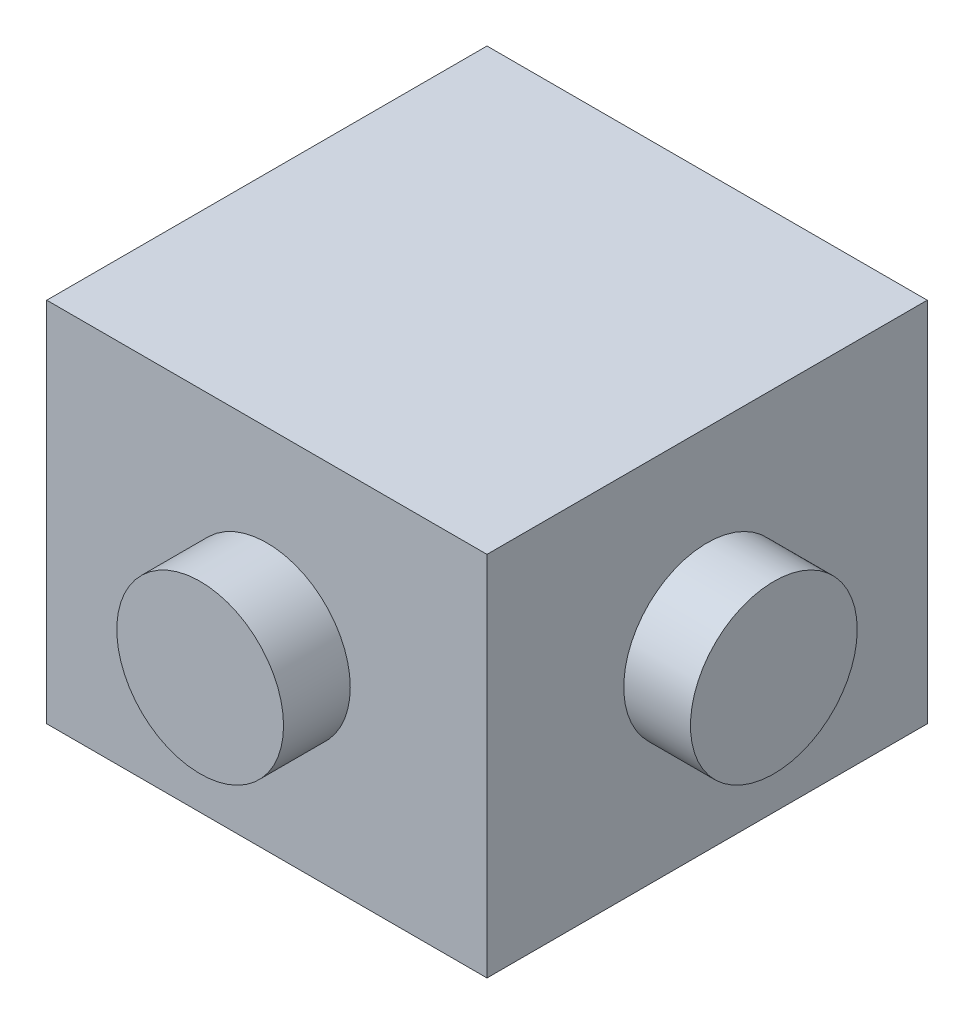
ISO-10303-21;
HEADER;
FILE_DESCRIPTION(('STEP AP214'),'2;1');
FILE_NAME('part.step','',(''),(''),'','','');
FILE_SCHEMA(('AUTOMOTIVE_DESIGN { 1 0 10303 214 1 1 1 1 }'));
ENDSEC;
DATA;
#1=APPLICATION_CONTEXT('core data for automotive mechanical design processes');
#2=APPLICATION_PROTOCOL_DEFINITION('international standard','automotive_design',2000,#1);
#3=PRODUCT_CONTEXT('',#1,'mechanical');
#4=PRODUCT('Part','Part','',(#3));
#5=PRODUCT_RELATED_PRODUCT_CATEGORY('part','',(#4));
#6=PRODUCT_DEFINITION_FORMATION('','',#4);
#7=PRODUCT_DEFINITION_CONTEXT('part definition',#1,'design');
#8=PRODUCT_DEFINITION('design','',#6,#7);
#9=PRODUCT_DEFINITION_SHAPE('','',#8);
#10=(LENGTH_UNIT() NAMED_UNIT(*) SI_UNIT(.MILLI.,.METRE.));
#11=(NAMED_UNIT(*) PLANE_ANGLE_UNIT() SI_UNIT($,.RADIAN.));
#12=(NAMED_UNIT(*) SI_UNIT($,.STERADIAN.) SOLID_ANGLE_UNIT());
#13=UNCERTAINTY_MEASURE_WITH_UNIT(LENGTH_MEASURE(1.E-05),#10,'distance_accuracy_value','');
#14=(GEOMETRIC_REPRESENTATION_CONTEXT(3) GLOBAL_UNCERTAINTY_ASSIGNED_CONTEXT((#13)) GLOBAL_UNIT_ASSIGNED_CONTEXT((#10,
#11,#12)) REPRESENTATION_CONTEXT('',''));
#15=CARTESIAN_POINT('',(0.,0.,0.));
#16=DIRECTION('',(0.,0.,1.));
#17=DIRECTION('',(1.,0.,0.));
#18=AXIS2_PLACEMENT_3D('',#15,#16,#17);
#19=CARTESIAN_POINT('',(8.382,13.97,8.382));
#20=DIRECTION('',(-1.,0.,0.));
#21=DIRECTION('',(0.,0.,1.));
#22=AXIS2_PLACEMENT_3D('',#19,#20,#21);
#23=PLANE('',#22);
#24=CARTESIAN_POINT('',(8.382,6.985,0.));
#25=DIRECTION('',(1.,0.,0.));
#26=DIRECTION('',(0.,0.,-1.));
#27=AXIS2_PLACEMENT_3D('',#24,#25,#26);
#28=CIRCLE('',#27,3.175);
#29=CARTESIAN_POINT('',(8.382,6.985,-3.175));
#30=VERTEX_POINT('',#29);
#31=EDGE_CURVE('E11',#30,#30,#28,.T.);
#32=ORIENTED_EDGE('',*,*,#31,.F.);
#33=EDGE_LOOP('',(#32));
#34=FACE_BOUND('',#33,.T.);
#35=DIRECTION('',(0.,0.,-1.));
#36=VECTOR('',#35,1.);
#37=CARTESIAN_POINT('',(8.382,0.,8.382));
#38=LINE('',#37,#36);
#39=CARTESIAN_POINT('',(8.382,0.,8.382));
#40=VERTEX_POINT('',#39);
#41=CARTESIAN_POINT('',(8.382,0.,-8.382));
#42=VERTEX_POINT('',#41);
#43=EDGE_CURVE('E111',#40,#42,#38,.T.);
#44=ORIENTED_EDGE('',*,*,#43,.T.);
#45=DIRECTION('',(0.,-1.,0.));
#46=VECTOR('',#45,1.);
#47=CARTESIAN_POINT('',(8.382,13.97,-8.382));
#48=LINE('',#47,#46);
#49=CARTESIAN_POINT('',(8.382,13.97,-8.382));
#50=VERTEX_POINT('',#49);
#51=EDGE_CURVE('E42',#50,#42,#48,.T.);
#52=ORIENTED_EDGE('',*,*,#51,.F.);
#53=DIRECTION('',(0.,0.,-1.));
#54=VECTOR('',#53,1.);
#55=CARTESIAN_POINT('',(8.382,13.97,8.382));
#56=LINE('',#55,#54);
#57=CARTESIAN_POINT('',(8.382,13.97,8.382));
#58=VERTEX_POINT('',#57);
#59=EDGE_CURVE('E94',#58,#50,#56,.T.);
#60=ORIENTED_EDGE('',*,*,#59,.F.);
#61=DIRECTION('',(0.,-1.,0.));
#62=VECTOR('',#61,1.);
#63=CARTESIAN_POINT('',(8.382,13.97,8.382));
#64=LINE('',#63,#62);
#65=EDGE_CURVE('E107',#58,#40,#64,.T.);
#66=ORIENTED_EDGE('',*,*,#65,.T.);
#67=EDGE_LOOP('',(#44,#52,#60,#66));
#68=FACE_BOUND('',#67,.T.);
#69=ADVANCED_FACE('F39',(#34,#68),#23,.F.);
#70=CARTESIAN_POINT('',(-8.382,13.97,-8.382));
#71=DIRECTION('',(0.,0.,1.));
#72=DIRECTION('',(1.,0.,0.));
#73=AXIS2_PLACEMENT_3D('',#70,#71,#72);
#74=PLANE('',#73);
#75=CARTESIAN_POINT('',(0.,6.985,-8.382));
#76=DIRECTION('',(0.,0.,1.));
#77=DIRECTION('',(1.,0.,0.));
#78=AXIS2_PLACEMENT_3D('',#75,#76,#77);
#79=CIRCLE('',#78,3.175);
#80=CARTESIAN_POINT('',(3.175,6.985,-8.382));
#81=VERTEX_POINT('',#80);
#82=EDGE_CURVE('E139',#81,#81,#79,.T.);
#83=ORIENTED_EDGE('',*,*,#82,.T.);
#84=EDGE_LOOP('',(#83));
#85=FACE_BOUND('',#84,.T.);
#86=DIRECTION('',(-1.,0.,0.));
#87=VECTOR('',#86,1.);
#88=CARTESIAN_POINT('',(-8.382,0.,-8.382));
#89=LINE('',#88,#87);
#90=CARTESIAN_POINT('',(-8.382,0.,-8.382));
#91=VERTEX_POINT('',#90);
#92=EDGE_CURVE('E100',#42,#91,#89,.T.);
#93=ORIENTED_EDGE('',*,*,#92,.T.);
#94=DIRECTION('',(0.,-1.,0.));
#95=VECTOR('',#94,1.);
#96=CARTESIAN_POINT('',(-8.382,13.97,-8.382));
#97=LINE('',#96,#95);
#98=CARTESIAN_POINT('',(-8.382,13.97,-8.382));
#99=VERTEX_POINT('',#98);
#100=EDGE_CURVE('E98',#99,#91,#97,.T.);
#101=ORIENTED_EDGE('',*,*,#100,.F.);
#102=DIRECTION('',(-1.,0.,0.));
#103=VECTOR('',#102,1.);
#104=CARTESIAN_POINT('',(-8.382,13.97,-8.382));
#105=LINE('',#104,#103);
#106=EDGE_CURVE('E89',#50,#99,#105,.T.);
#107=ORIENTED_EDGE('',*,*,#106,.F.);
#108=ORIENTED_EDGE('',*,*,#51,.T.);
#109=EDGE_LOOP('',(#93,#101,#107,#108));
#110=FACE_BOUND('',#109,.T.);
#111=ADVANCED_FACE('F99',(#85,#110),#74,.F.);
#112=CARTESIAN_POINT('',(-8.382,13.97,8.382));
#113=DIRECTION('',(1.,0.,0.));
#114=DIRECTION('',(0.,0.,-1.));
#115=AXIS2_PLACEMENT_3D('',#112,#113,#114);
#116=PLANE('',#115);
#117=CARTESIAN_POINT('',(-8.382,6.985,0.));
#118=DIRECTION('',(1.,0.,0.));
#119=DIRECTION('',(0.,0.,-1.));
#120=AXIS2_PLACEMENT_3D('',#117,#118,#119);
#121=CIRCLE('',#120,3.175);
#122=CARTESIAN_POINT('',(-8.382,6.985,-3.175));
#123=VERTEX_POINT('',#122);
#124=EDGE_CURVE('E151',#123,#123,#121,.T.);
#125=ORIENTED_EDGE('',*,*,#124,.T.);
#126=EDGE_LOOP('',(#125));
#127=FACE_BOUND('',#126,.T.);
#128=DIRECTION('',(0.,0.,1.));
#129=VECTOR('',#128,1.);
#130=CARTESIAN_POINT('',(-8.382,0.,8.382));
#131=LINE('',#130,#129);
#132=CARTESIAN_POINT('',(-8.382,0.,8.382));
#133=VERTEX_POINT('',#132);
#134=EDGE_CURVE('E75',#91,#133,#131,.T.);
#135=ORIENTED_EDGE('',*,*,#134,.T.);
#136=DIRECTION('',(0.,-1.,0.));
#137=VECTOR('',#136,1.);
#138=CARTESIAN_POINT('',(-8.382,13.97,8.382));
#139=LINE('',#138,#137);
#140=CARTESIAN_POINT('',(-8.382,13.97,8.382));
#141=VERTEX_POINT('',#140);
#142=EDGE_CURVE('E102',#141,#133,#139,.T.);
#143=ORIENTED_EDGE('',*,*,#142,.F.);
#144=DIRECTION('',(0.,0.,1.));
#145=VECTOR('',#144,1.);
#146=CARTESIAN_POINT('',(-8.382,13.97,8.382));
#147=LINE('',#146,#145);
#148=EDGE_CURVE('E92',#99,#141,#147,.T.);
#149=ORIENTED_EDGE('',*,*,#148,.F.);
#150=ORIENTED_EDGE('',*,*,#100,.T.);
#151=EDGE_LOOP('',(#135,#143,#149,#150));
#152=FACE_BOUND('',#151,.T.);
#153=ADVANCED_FACE('F103',(#127,#152),#116,.F.);
#154=CARTESIAN_POINT('',(-8.382,13.97,8.382));
#155=DIRECTION('',(0.,0.,-1.));
#156=DIRECTION('',(-1.,0.,0.));
#157=AXIS2_PLACEMENT_3D('',#154,#155,#156);
#158=PLANE('',#157);
#159=CARTESIAN_POINT('',(0.,6.985,8.382));
#160=DIRECTION('',(0.,0.,1.));
#161=DIRECTION('',(1.,0.,0.));
#162=AXIS2_PLACEMENT_3D('',#159,#160,#161);
#163=CIRCLE('',#162,3.175);
#164=CARTESIAN_POINT('',(3.175,6.985,8.382));
#165=VERTEX_POINT('',#164);
#166=EDGE_CURVE('E49',#165,#165,#163,.T.);
#167=ORIENTED_EDGE('',*,*,#166,.F.);
#168=EDGE_LOOP('',(#167));
#169=FACE_BOUND('',#168,.T.);
#170=DIRECTION('',(1.,0.,0.));
#171=VECTOR('',#170,1.);
#172=CARTESIAN_POINT('',(-8.382,0.,8.382));
#173=LINE('',#172,#171);
#174=EDGE_CURVE('E81',#133,#40,#173,.T.);
#175=ORIENTED_EDGE('',*,*,#174,.T.);
#176=ORIENTED_EDGE('',*,*,#65,.F.);
#177=DIRECTION('',(1.,0.,0.));
#178=VECTOR('',#177,1.);
#179=CARTESIAN_POINT('',(-8.382,13.97,8.382));
#180=LINE('',#179,#178);
#181=EDGE_CURVE('E58',#141,#58,#180,.T.);
#182=ORIENTED_EDGE('',*,*,#181,.F.);
#183=ORIENTED_EDGE('',*,*,#142,.T.);
#184=EDGE_LOOP('',(#175,#176,#182,#183));
#185=FACE_BOUND('',#184,.T.);
#186=ADVANCED_FACE('F125',(#169,#185),#158,.F.);
#187=CARTESIAN_POINT('',(0.,13.97,0.));
#188=DIRECTION('',(0.,-1.,0.));
#189=DIRECTION('',(0.,0.,-1.));
#190=AXIS2_PLACEMENT_3D('',#187,#188,#189);
#191=PLANE('',#190);
#192=ORIENTED_EDGE('',*,*,#59,.T.);
#193=ORIENTED_EDGE('',*,*,#106,.T.);
#194=ORIENTED_EDGE('',*,*,#148,.T.);
#195=ORIENTED_EDGE('',*,*,#181,.T.);
#196=EDGE_LOOP('',(#192,#193,#194,#195));
#197=FACE_BOUND('',#196,.T.);
#198=ADVANCED_FACE('F90',(#197),#191,.F.);
#199=CARTESIAN_POINT('',(0.,0.,0.));
#200=DIRECTION('',(0.,-1.,0.));
#201=DIRECTION('',(0.,0.,-1.));
#202=AXIS2_PLACEMENT_3D('',#199,#200,#201);
#203=PLANE('',#202);
#204=ORIENTED_EDGE('',*,*,#43,.F.);
#205=ORIENTED_EDGE('',*,*,#174,.F.);
#206=ORIENTED_EDGE('',*,*,#134,.F.);
#207=ORIENTED_EDGE('',*,*,#92,.F.);
#208=EDGE_LOOP('',(#204,#205,#206,#207));
#209=FACE_BOUND('',#208,.T.);
#210=ADVANCED_FACE('F128',(#209),#203,.T.);
#211=CARTESIAN_POINT('',(0.,6.985,10.922));
#212=DIRECTION('',(0.,0.,-1.));
#213=DIRECTION('',(-1.,0.,0.));
#214=AXIS2_PLACEMENT_3D('',#211,#212,#213);
#215=CYLINDRICAL_SURFACE('',#214,3.175);
#216=CARTESIAN_POINT('',(0.,6.985,10.922));
#217=DIRECTION('',(0.,0.,1.));
#218=DIRECTION('',(1.,0.,0.));
#219=AXIS2_PLACEMENT_3D('',#216,#217,#218);
#220=CIRCLE('',#219,3.175);
#221=CARTESIAN_POINT('',(3.175,6.985,10.922));
#222=VERTEX_POINT('',#221);
#223=EDGE_CURVE('E115',#222,#222,#220,.T.);
#224=ORIENTED_EDGE('',*,*,#223,.F.);
#225=EDGE_LOOP('',(#224));
#226=FACE_BOUND('',#225,.T.);
#227=ORIENTED_EDGE('',*,*,#166,.T.);
#228=EDGE_LOOP('',(#227));
#229=FACE_BOUND('',#228,.T.);
#230=ADVANCED_FACE('F201',(#226,#229),#215,.T.);
#231=CARTESIAN_POINT('',(0.,6.985,10.922));
#232=DIRECTION('',(0.,0.,1.));
#233=DIRECTION('',(1.,0.,0.));
#234=AXIS2_PLACEMENT_3D('',#231,#232,#233);
#235=PLANE('',#234);
#236=ORIENTED_EDGE('',*,*,#223,.T.);
#237=EDGE_LOOP('',(#236));
#238=FACE_BOUND('',#237,.T.);
#239=ADVANCED_FACE('F197',(#238),#235,.T.);
#240=CARTESIAN_POINT('',(0.,6.985,-10.922));
#241=DIRECTION('',(0.,0.,1.));
#242=DIRECTION('',(1.,0.,0.));
#243=AXIS2_PLACEMENT_3D('',#240,#241,#242);
#244=CYLINDRICAL_SURFACE('',#243,3.175);
#245=CARTESIAN_POINT('',(0.,6.985,-10.922));
#246=DIRECTION('',(0.,0.,1.));
#247=DIRECTION('',(1.,0.,0.));
#248=AXIS2_PLACEMENT_3D('',#245,#246,#247);
#249=CIRCLE('',#248,3.175);
#250=CARTESIAN_POINT('',(3.175,6.985,-10.922));
#251=VERTEX_POINT('',#250);
#252=EDGE_CURVE('E138',#251,#251,#249,.T.);
#253=ORIENTED_EDGE('',*,*,#252,.T.);
#254=EDGE_LOOP('',(#253));
#255=FACE_BOUND('',#254,.T.);
#256=ORIENTED_EDGE('',*,*,#82,.F.);
#257=EDGE_LOOP('',(#256));
#258=FACE_BOUND('',#257,.T.);
#259=ADVANCED_FACE('F190',(#255,#258),#244,.T.);
#260=CARTESIAN_POINT('',(0.,6.985,-10.922));
#261=DIRECTION('',(0.,0.,-1.));
#262=DIRECTION('',(1.,0.,0.));
#263=AXIS2_PLACEMENT_3D('',#260,#261,#262);
#264=PLANE('',#263);
#265=ORIENTED_EDGE('',*,*,#252,.F.);
#266=EDGE_LOOP('',(#265));
#267=FACE_BOUND('',#266,.T.);
#268=ADVANCED_FACE('F182',(#267),#264,.T.);
#269=CARTESIAN_POINT('',(10.922,6.985,0.));
#270=DIRECTION('',(-1.,0.,0.));
#271=DIRECTION('',(0.,0.,1.));
#272=AXIS2_PLACEMENT_3D('',#269,#270,#271);
#273=CYLINDRICAL_SURFACE('',#272,3.175);
#274=CARTESIAN_POINT('',(10.922,6.985,0.));
#275=DIRECTION('',(1.,0.,0.));
#276=DIRECTION('',(0.,0.,-1.));
#277=AXIS2_PLACEMENT_3D('',#274,#275,#276);
#278=CIRCLE('',#277,3.175);
#279=CARTESIAN_POINT('',(10.922,6.985,-3.175));
#280=VERTEX_POINT('',#279);
#281=EDGE_CURVE('E143',#280,#280,#278,.T.);
#282=ORIENTED_EDGE('',*,*,#281,.F.);
#283=EDGE_LOOP('',(#282));
#284=FACE_BOUND('',#283,.T.);
#285=ORIENTED_EDGE('',*,*,#31,.T.);
#286=EDGE_LOOP('',(#285));
#287=FACE_BOUND('',#286,.T.);
#288=ADVANCED_FACE('F180',(#284,#287),#273,.T.);
#289=CARTESIAN_POINT('',(10.922,6.985,0.));
#290=DIRECTION('',(1.,0.,0.));
#291=DIRECTION('',(0.,0.,-1.));
#292=AXIS2_PLACEMENT_3D('',#289,#290,#291);
#293=PLANE('',#292);
#294=ORIENTED_EDGE('',*,*,#281,.T.);
#295=EDGE_LOOP('',(#294));
#296=FACE_BOUND('',#295,.T.);
#297=ADVANCED_FACE('F168',(#296),#293,.T.);
#298=CARTESIAN_POINT('',(-10.922,6.985,0.));
#299=DIRECTION('',(1.,0.,0.));
#300=DIRECTION('',(0.,0.,-1.));
#301=AXIS2_PLACEMENT_3D('',#298,#299,#300);
#302=CYLINDRICAL_SURFACE('',#301,3.175);
#303=CARTESIAN_POINT('',(-10.922,6.985,0.));
#304=DIRECTION('',(1.,0.,0.));
#305=DIRECTION('',(0.,0.,-1.));
#306=AXIS2_PLACEMENT_3D('',#303,#304,#305);
#307=CIRCLE('',#306,3.175);
#308=CARTESIAN_POINT('',(-10.922,6.985,-3.175));
#309=VERTEX_POINT('',#308);
#310=EDGE_CURVE('E150',#309,#309,#307,.T.);
#311=ORIENTED_EDGE('',*,*,#310,.T.);
#312=EDGE_LOOP('',(#311));
#313=FACE_BOUND('',#312,.T.);
#314=ORIENTED_EDGE('',*,*,#124,.F.);
#315=EDGE_LOOP('',(#314));
#316=FACE_BOUND('',#315,.T.);
#317=ADVANCED_FACE('F159',(#313,#316),#302,.T.);
#318=CARTESIAN_POINT('',(-10.922,6.985,0.));
#319=DIRECTION('',(-1.,0.,0.));
#320=DIRECTION('',(0.,0.,-1.));
#321=AXIS2_PLACEMENT_3D('',#318,#319,#320);
#322=PLANE('',#321);
#323=ORIENTED_EDGE('',*,*,#310,.F.);
#324=EDGE_LOOP('',(#323));
#325=FACE_BOUND('',#324,.T.);
#326=ADVANCED_FACE('F162',(#325),#322,.T.);
#327=CLOSED_SHELL('',(#69,#111,#153,#186,#198,#210,#230,#239,#259,#268,#288,#297,#317,#326));
#328=MANIFOLD_SOLID_BREP('B2',#327);
#329=ADVANCED_BREP_SHAPE_REPRESENTATION('',(#18,#328),#14);
#330=SHAPE_DEFINITION_REPRESENTATION(#9,#329);
ENDSEC;
END-ISO-10303-21;
